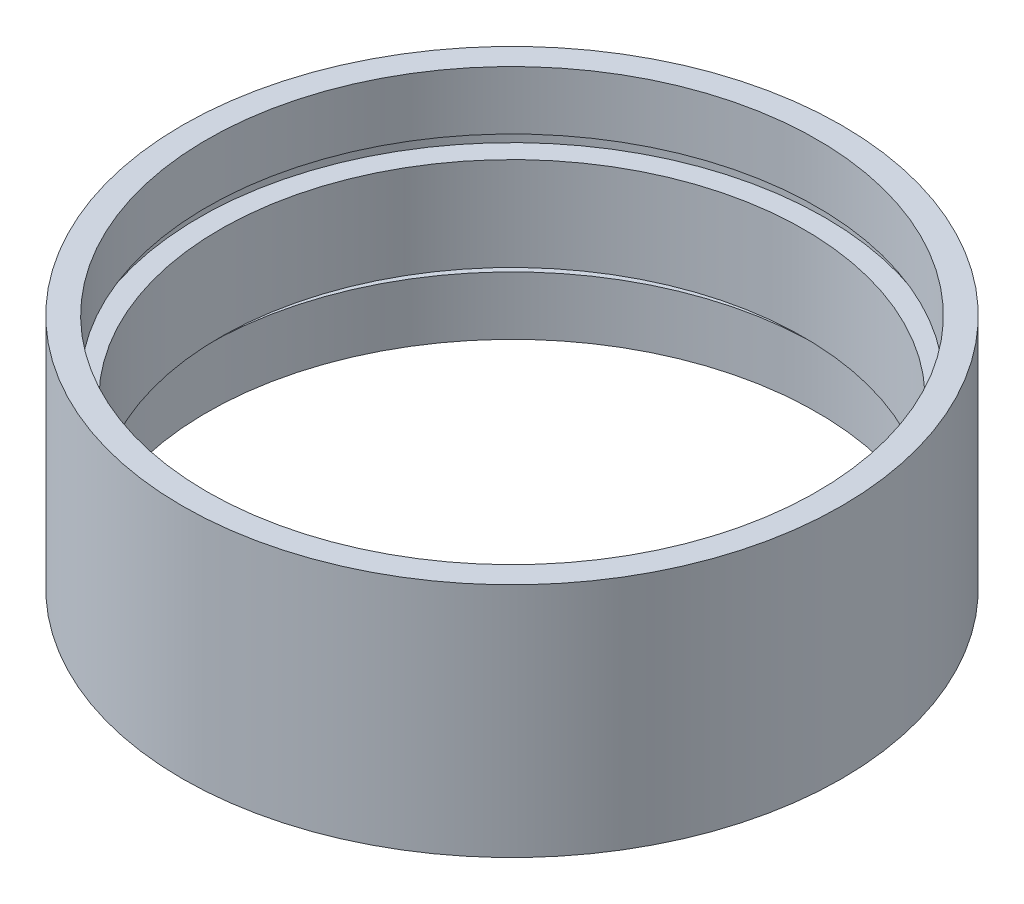
ISO-10303-21;
HEADER;
FILE_DESCRIPTION(('STEP AP214'),'2;1');
FILE_NAME('part.step','',(''),(''),'','','');
FILE_SCHEMA(('AUTOMOTIVE_DESIGN { 1 0 10303 214 1 1 1 1 }'));
ENDSEC;
DATA;
#1=APPLICATION_CONTEXT('core data for automotive mechanical design processes');
#2=APPLICATION_PROTOCOL_DEFINITION('international standard','automotive_design',2000,#1);
#3=PRODUCT_CONTEXT('',#1,'mechanical');
#4=PRODUCT('Part','Part','',(#3));
#5=PRODUCT_RELATED_PRODUCT_CATEGORY('part','',(#4));
#6=PRODUCT_DEFINITION_FORMATION('','',#4);
#7=PRODUCT_DEFINITION_CONTEXT('part definition',#1,'design');
#8=PRODUCT_DEFINITION('design','',#6,#7);
#9=PRODUCT_DEFINITION_SHAPE('','',#8);
#10=(LENGTH_UNIT() NAMED_UNIT(*) SI_UNIT(.MILLI.,.METRE.));
#11=(NAMED_UNIT(*) PLANE_ANGLE_UNIT() SI_UNIT($,.RADIAN.));
#12=(NAMED_UNIT(*) SI_UNIT($,.STERADIAN.) SOLID_ANGLE_UNIT());
#13=UNCERTAINTY_MEASURE_WITH_UNIT(LENGTH_MEASURE(1.E-05),#10,'distance_accuracy_value','');
#14=(GEOMETRIC_REPRESENTATION_CONTEXT(3) GLOBAL_UNCERTAINTY_ASSIGNED_CONTEXT((#13)) GLOBAL_UNIT_ASSIGNED_CONTEXT((#10,
#11,#12)) REPRESENTATION_CONTEXT('',''));
#15=CARTESIAN_POINT('',(0.,0.,0.));
#16=DIRECTION('',(0.,0.,1.));
#17=DIRECTION('',(1.,0.,0.));
#18=AXIS2_PLACEMENT_3D('',#15,#16,#17);
#19=CARTESIAN_POINT('',(23.5,0.,0.));
#20=DIRECTION('',(0.,1.,0.));
#21=DIRECTION('',(0.,0.,1.));
#22=AXIS2_PLACEMENT_3D('',#19,#20,#21);
#23=PLANE('',#22);
#24=CARTESIAN_POINT('',(0.,0.,0.));
#25=DIRECTION('',(0.,1.,0.));
#26=DIRECTION('',(0.,0.,1.));
#27=AXIS2_PLACEMENT_3D('',#24,#25,#26);
#28=CIRCLE('',#27,25.4);
#29=CARTESIAN_POINT('',(0.,0.,25.4));
#30=VERTEX_POINT('',#29);
#31=EDGE_CURVE('E10',#30,#30,#28,.T.);
#32=ORIENTED_EDGE('',*,*,#31,.F.);
#33=EDGE_LOOP('',(#32));
#34=FACE_BOUND('',#33,.T.);
#35=CARTESIAN_POINT('',(0.,0.,0.));
#36=DIRECTION('',(0.,1.,0.));
#37=DIRECTION('',(0.,0.,1.));
#38=AXIS2_PLACEMENT_3D('',#35,#36,#37);
#39=CIRCLE('',#38,23.5);
#40=CARTESIAN_POINT('',(0.,0.,23.5));
#41=VERTEX_POINT('',#40);
#42=EDGE_CURVE('E77',#41,#41,#39,.T.);
#43=ORIENTED_EDGE('',*,*,#42,.T.);
#44=EDGE_LOOP('',(#43));
#45=FACE_BOUND('',#44,.T.);
#46=ADVANCED_FACE('F37',(#34,#45),#23,.F.);
#47=CARTESIAN_POINT('',(0.,161.376166943427,0.));
#48=DIRECTION('',(0.,1.,0.));
#49=DIRECTION('',(0.,0.,1.));
#50=AXIS2_PLACEMENT_3D('',#47,#48,#49);
#51=CYLINDRICAL_SURFACE('',#50,25.4);
#52=CARTESIAN_POINT('',(0.,18.2,0.));
#53=DIRECTION('',(0.,1.,0.));
#54=DIRECTION('',(0.,0.,1.));
#55=AXIS2_PLACEMENT_3D('',#52,#53,#54);
#56=CIRCLE('',#55,25.4);
#57=CARTESIAN_POINT('',(0.,18.2,25.4));
#58=VERTEX_POINT('',#57);
#59=EDGE_CURVE('E43',#58,#58,#56,.T.);
#60=ORIENTED_EDGE('',*,*,#59,.F.);
#61=EDGE_LOOP('',(#60));
#62=FACE_BOUND('',#61,.T.);
#63=ORIENTED_EDGE('',*,*,#31,.T.);
#64=EDGE_LOOP('',(#63));
#65=FACE_BOUND('',#64,.T.);
#66=ADVANCED_FACE('F138',(#62,#65),#51,.T.);
#67=CARTESIAN_POINT('',(23.5,18.2,0.));
#68=DIRECTION('',(0.,-1.,0.));
#69=DIRECTION('',(0.,0.,-1.));
#70=AXIS2_PLACEMENT_3D('',#67,#68,#69);
#71=PLANE('',#70);
#72=CARTESIAN_POINT('',(0.,18.2,0.));
#73=DIRECTION('',(0.,1.,0.));
#74=DIRECTION('',(0.,0.,1.));
#75=AXIS2_PLACEMENT_3D('',#72,#73,#74);
#76=CIRCLE('',#75,23.5);
#77=CARTESIAN_POINT('',(0.,18.2,23.5));
#78=VERTEX_POINT('',#77);
#79=EDGE_CURVE('E47',#78,#78,#76,.T.);
#80=ORIENTED_EDGE('',*,*,#79,.F.);
#81=EDGE_LOOP('',(#80));
#82=FACE_BOUND('',#81,.T.);
#83=ORIENTED_EDGE('',*,*,#59,.T.);
#84=EDGE_LOOP('',(#83));
#85=FACE_BOUND('',#84,.T.);
#86=ADVANCED_FACE('F133',(#82,#85),#71,.F.);
#87=CARTESIAN_POINT('',(0.,161.376166943427,0.));
#88=DIRECTION('',(0.,1.,0.));
#89=DIRECTION('',(0.,0.,1.));
#90=AXIS2_PLACEMENT_3D('',#87,#88,#89);
#91=CYLINDRICAL_SURFACE('',#90,23.5);
#92=CARTESIAN_POINT('',(0.,13.7,0.));
#93=DIRECTION('',(0.,1.,0.));
#94=DIRECTION('',(0.,0.,1.));
#95=AXIS2_PLACEMENT_3D('',#92,#93,#94);
#96=CIRCLE('',#95,23.5);
#97=CARTESIAN_POINT('',(0.,13.7,23.5));
#98=VERTEX_POINT('',#97);
#99=EDGE_CURVE('E51',#98,#98,#96,.T.);
#100=ORIENTED_EDGE('',*,*,#99,.F.);
#101=EDGE_LOOP('',(#100));
#102=FACE_BOUND('',#101,.T.);
#103=ORIENTED_EDGE('',*,*,#79,.T.);
#104=EDGE_LOOP('',(#103));
#105=FACE_BOUND('',#104,.T.);
#106=ADVANCED_FACE('F127',(#102,#105),#91,.F.);
#107=CARTESIAN_POINT('',(24.1,13.7,0.));
#108=DIRECTION('',(0.,1.,0.));
#109=DIRECTION('',(0.,0.,1.));
#110=AXIS2_PLACEMENT_3D('',#107,#108,#109);
#111=PLANE('',#110);
#112=CARTESIAN_POINT('',(0.,13.7,0.));
#113=DIRECTION('',(0.,1.,0.));
#114=DIRECTION('',(0.,0.,1.));
#115=AXIS2_PLACEMENT_3D('',#112,#113,#114);
#116=CIRCLE('',#115,24.1);
#117=CARTESIAN_POINT('',(0.,13.7,24.1));
#118=VERTEX_POINT('',#117);
#119=EDGE_CURVE('E56',#118,#118,#116,.T.);
#120=ORIENTED_EDGE('',*,*,#119,.F.);
#121=EDGE_LOOP('',(#120));
#122=FACE_BOUND('',#121,.T.);
#123=ORIENTED_EDGE('',*,*,#99,.T.);
#124=EDGE_LOOP('',(#123));
#125=FACE_BOUND('',#124,.T.);
#126=ADVANCED_FACE('F121',(#122,#125),#111,.F.);
#127=CARTESIAN_POINT('',(0.,161.376166943427,0.));
#128=DIRECTION('',(0.,1.,0.));
#129=DIRECTION('',(0.,0.,1.));
#130=AXIS2_PLACEMENT_3D('',#127,#128,#129);
#131=CYLINDRICAL_SURFACE('',#130,24.1);
#132=CARTESIAN_POINT('',(0.,12.7,0.));
#133=DIRECTION('',(0.,1.,0.));
#134=DIRECTION('',(0.,0.,1.));
#135=AXIS2_PLACEMENT_3D('',#132,#133,#134);
#136=CIRCLE('',#135,24.1);
#137=CARTESIAN_POINT('',(0.,12.7,24.1));
#138=VERTEX_POINT('',#137);
#139=EDGE_CURVE('E59',#138,#138,#136,.T.);
#140=ORIENTED_EDGE('',*,*,#139,.F.);
#141=EDGE_LOOP('',(#140));
#142=FACE_BOUND('',#141,.T.);
#143=ORIENTED_EDGE('',*,*,#119,.T.);
#144=EDGE_LOOP('',(#143));
#145=FACE_BOUND('',#144,.T.);
#146=ADVANCED_FACE('F115',(#142,#145),#131,.F.);
#147=CARTESIAN_POINT('',(22.5,12.7,0.));
#148=DIRECTION('',(0.,-1.,0.));
#149=DIRECTION('',(0.,0.,-1.));
#150=AXIS2_PLACEMENT_3D('',#147,#148,#149);
#151=PLANE('',#150);
#152=CARTESIAN_POINT('',(0.,12.7,0.));
#153=DIRECTION('',(0.,1.,0.));
#154=DIRECTION('',(0.,0.,1.));
#155=AXIS2_PLACEMENT_3D('',#152,#153,#154);
#156=CIRCLE('',#155,22.5);
#157=CARTESIAN_POINT('',(0.,12.7,22.5));
#158=VERTEX_POINT('',#157);
#159=EDGE_CURVE('E62',#158,#158,#156,.T.);
#160=ORIENTED_EDGE('',*,*,#159,.F.);
#161=EDGE_LOOP('',(#160));
#162=FACE_BOUND('',#161,.T.);
#163=ORIENTED_EDGE('',*,*,#139,.T.);
#164=EDGE_LOOP('',(#163));
#165=FACE_BOUND('',#164,.T.);
#166=ADVANCED_FACE('F109',(#162,#165),#151,.F.);
#167=CARTESIAN_POINT('',(0.,161.376166943427,0.));
#168=DIRECTION('',(0.,1.,0.));
#169=DIRECTION('',(0.,0.,1.));
#170=AXIS2_PLACEMENT_3D('',#167,#168,#169);
#171=CYLINDRICAL_SURFACE('',#170,22.5);
#172=CARTESIAN_POINT('',(0.,5.49999999999998,0.));
#173=DIRECTION('',(0.,1.,0.));
#174=DIRECTION('',(0.,0.,1.));
#175=AXIS2_PLACEMENT_3D('',#172,#173,#174);
#176=CIRCLE('',#175,22.5);
#177=CARTESIAN_POINT('',(0.,5.49999999999998,22.5));
#178=VERTEX_POINT('',#177);
#179=EDGE_CURVE('E65',#178,#178,#176,.T.);
#180=ORIENTED_EDGE('',*,*,#179,.F.);
#181=EDGE_LOOP('',(#180));
#182=FACE_BOUND('',#181,.T.);
#183=ORIENTED_EDGE('',*,*,#159,.T.);
#184=EDGE_LOOP('',(#183));
#185=FACE_BOUND('',#184,.T.);
#186=ADVANCED_FACE('F103',(#182,#185),#171,.F.);
#187=CARTESIAN_POINT('',(22.5,5.49999999999998,0.));
#188=DIRECTION('',(0.,1.,0.));
#189=DIRECTION('',(0.,0.,1.));
#190=AXIS2_PLACEMENT_3D('',#187,#188,#189);
#191=PLANE('',#190);
#192=CARTESIAN_POINT('',(0.,5.49999999999998,0.));
#193=DIRECTION('',(0.,1.,0.));
#194=DIRECTION('',(0.,0.,1.));
#195=AXIS2_PLACEMENT_3D('',#192,#193,#194);
#196=CIRCLE('',#195,24.1);
#197=CARTESIAN_POINT('',(0.,5.49999999999998,24.1));
#198=VERTEX_POINT('',#197);
#199=EDGE_CURVE('E68',#198,#198,#196,.T.);
#200=ORIENTED_EDGE('',*,*,#199,.F.);
#201=EDGE_LOOP('',(#200));
#202=FACE_BOUND('',#201,.T.);
#203=ORIENTED_EDGE('',*,*,#179,.T.);
#204=EDGE_LOOP('',(#203));
#205=FACE_BOUND('',#204,.T.);
#206=ADVANCED_FACE('F97',(#202,#205),#191,.F.);
#207=CARTESIAN_POINT('',(0.,161.376166943427,0.));
#208=DIRECTION('',(0.,1.,0.));
#209=DIRECTION('',(0.,0.,1.));
#210=AXIS2_PLACEMENT_3D('',#207,#208,#209);
#211=CYLINDRICAL_SURFACE('',#210,24.1);
#212=CARTESIAN_POINT('',(0.,4.49999999999998,0.));
#213=DIRECTION('',(0.,1.,0.));
#214=DIRECTION('',(0.,0.,1.));
#215=AXIS2_PLACEMENT_3D('',#212,#213,#214);
#216=CIRCLE('',#215,24.1);
#217=CARTESIAN_POINT('',(0.,4.49999999999998,24.1));
#218=VERTEX_POINT('',#217);
#219=EDGE_CURVE('E71',#218,#218,#216,.T.);
#220=ORIENTED_EDGE('',*,*,#219,.F.);
#221=EDGE_LOOP('',(#220));
#222=FACE_BOUND('',#221,.T.);
#223=ORIENTED_EDGE('',*,*,#199,.T.);
#224=EDGE_LOOP('',(#223));
#225=FACE_BOUND('',#224,.T.);
#226=ADVANCED_FACE('F91',(#222,#225),#211,.F.);
#227=CARTESIAN_POINT('',(23.5,4.49999999999998,0.));
#228=DIRECTION('',(0.,-1.,0.));
#229=DIRECTION('',(0.,0.,-1.));
#230=AXIS2_PLACEMENT_3D('',#227,#228,#229);
#231=PLANE('',#230);
#232=CARTESIAN_POINT('',(0.,4.49999999999998,0.));
#233=DIRECTION('',(0.,1.,0.));
#234=DIRECTION('',(0.,0.,1.));
#235=AXIS2_PLACEMENT_3D('',#232,#233,#234);
#236=CIRCLE('',#235,23.5);
#237=CARTESIAN_POINT('',(0.,4.49999999999998,23.5));
#238=VERTEX_POINT('',#237);
#239=EDGE_CURVE('E74',#238,#238,#236,.T.);
#240=ORIENTED_EDGE('',*,*,#239,.F.);
#241=EDGE_LOOP('',(#240));
#242=FACE_BOUND('',#241,.T.);
#243=ORIENTED_EDGE('',*,*,#219,.T.);
#244=EDGE_LOOP('',(#243));
#245=FACE_BOUND('',#244,.T.);
#246=ADVANCED_FACE('F85',(#242,#245),#231,.F.);
#247=CARTESIAN_POINT('',(0.,161.376166943427,0.));
#248=DIRECTION('',(0.,1.,0.));
#249=DIRECTION('',(0.,0.,1.));
#250=AXIS2_PLACEMENT_3D('',#247,#248,#249);
#251=CYLINDRICAL_SURFACE('',#250,23.5);
#252=ORIENTED_EDGE('',*,*,#42,.F.);
#253=EDGE_LOOP('',(#252));
#254=FACE_BOUND('',#253,.T.);
#255=ORIENTED_EDGE('',*,*,#239,.T.);
#256=EDGE_LOOP('',(#255));
#257=FACE_BOUND('',#256,.T.);
#258=ADVANCED_FACE('F82',(#254,#257),#251,.F.);
#259=CLOSED_SHELL('',(#46,#66,#86,#106,#126,#146,#166,#186,#206,#226,#246,#258));
#260=MANIFOLD_SOLID_BREP('B2',#259);
#261=ADVANCED_BREP_SHAPE_REPRESENTATION('',(#18,#260),#14);
#262=SHAPE_DEFINITION_REPRESENTATION(#9,#261);
ENDSEC;
END-ISO-10303-21;
